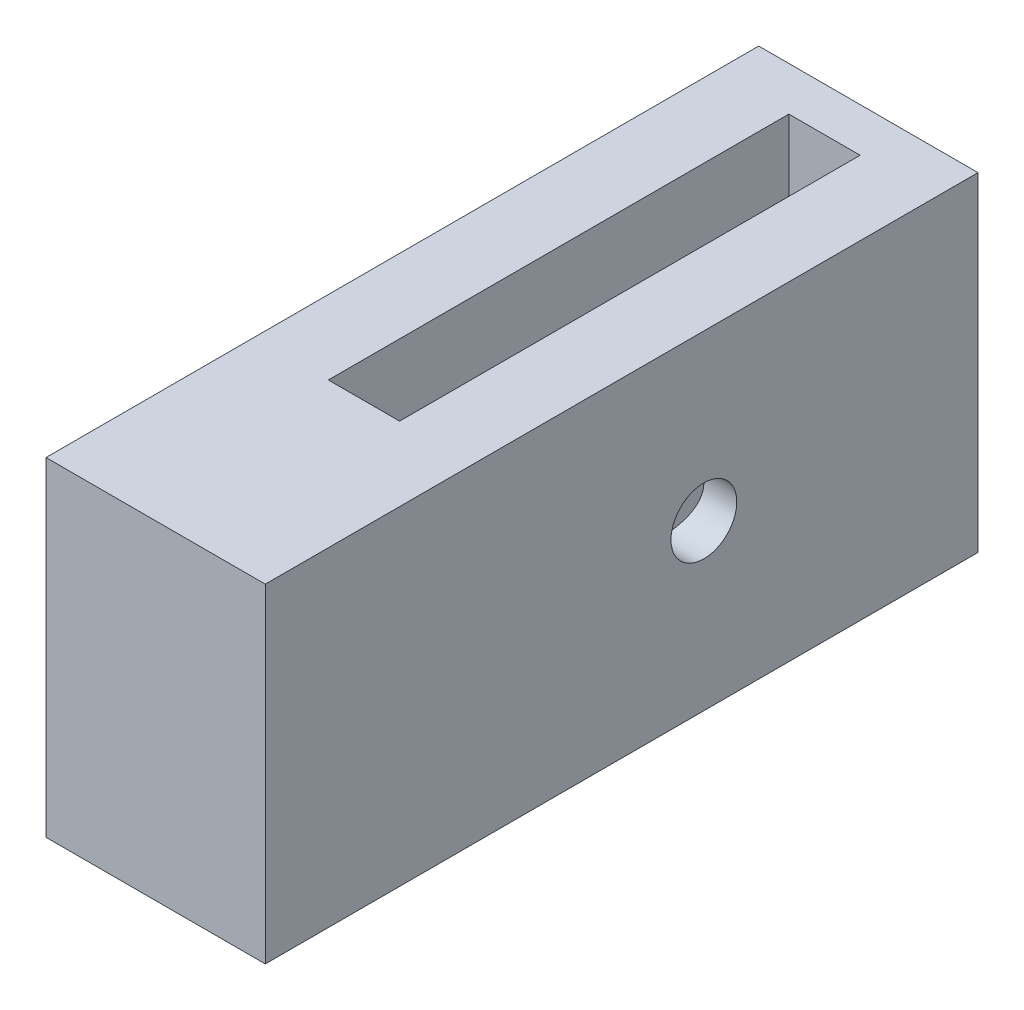
ISO-10303-21;
HEADER;
FILE_DESCRIPTION(('STEP AP214'),'2;1');
FILE_NAME('part.step','',(''),(''),'','','');
FILE_SCHEMA(('AUTOMOTIVE_DESIGN { 1 0 10303 214 1 1 1 1 }'));
ENDSEC;
DATA;
#1=APPLICATION_CONTEXT('core data for automotive mechanical design processes');
#2=APPLICATION_PROTOCOL_DEFINITION('international standard','automotive_design',2000,#1);
#3=PRODUCT_CONTEXT('',#1,'mechanical');
#4=PRODUCT('Part','Part','',(#3));
#5=PRODUCT_RELATED_PRODUCT_CATEGORY('part','',(#4));
#6=PRODUCT_DEFINITION_FORMATION('','',#4);
#7=PRODUCT_DEFINITION_CONTEXT('part definition',#1,'design');
#8=PRODUCT_DEFINITION('design','',#6,#7);
#9=PRODUCT_DEFINITION_SHAPE('','',#8);
#10=(LENGTH_UNIT() NAMED_UNIT(*) SI_UNIT(.MILLI.,.METRE.));
#11=(NAMED_UNIT(*) PLANE_ANGLE_UNIT() SI_UNIT($,.RADIAN.));
#12=(NAMED_UNIT(*) SI_UNIT($,.STERADIAN.) SOLID_ANGLE_UNIT());
#13=UNCERTAINTY_MEASURE_WITH_UNIT(LENGTH_MEASURE(1.E-05),#10,'distance_accuracy_value','');
#14=(GEOMETRIC_REPRESENTATION_CONTEXT(3) GLOBAL_UNCERTAINTY_ASSIGNED_CONTEXT((#13)) GLOBAL_UNIT_ASSIGNED_CONTEXT((#10,
#11,#12)) REPRESENTATION_CONTEXT('',''));
#15=CARTESIAN_POINT('',(0.,0.,0.));
#16=DIRECTION('',(0.,0.,1.));
#17=DIRECTION('',(1.,0.,0.));
#18=AXIS2_PLACEMENT_3D('',#15,#16,#17);
#19=CARTESIAN_POINT('',(10.,-15.,65.));
#20=DIRECTION('',(-1.,0.,0.));
#21=DIRECTION('',(0.,0.,1.));
#22=AXIS2_PLACEMENT_3D('',#19,#20,#21);
#23=PLANE('',#22);
#24=CARTESIAN_POINT('',(10.,0.,25.));
#25=DIRECTION('',(-1.,0.,0.));
#26=DIRECTION('',(0.,0.,1.));
#27=AXIS2_PLACEMENT_3D('',#24,#25,#26);
#28=CIRCLE('',#27,2.99999999999999);
#29=CARTESIAN_POINT('',(10.,0.,28.));
#30=VERTEX_POINT('',#29);
#31=EDGE_CURVE('E175',#30,#30,#28,.T.);
#32=ORIENTED_EDGE('',*,*,#31,.T.);
#33=EDGE_LOOP('',(#32));
#34=FACE_BOUND('',#33,.T.);
#35=DIRECTION('',(0.,1.,0.));
#36=VECTOR('',#35,1.);
#37=CARTESIAN_POINT('',(10.,-15.,0.));
#38=LINE('',#37,#36);
#39=CARTESIAN_POINT('',(10.,-15.,0.));
#40=VERTEX_POINT('',#39);
#41=CARTESIAN_POINT('',(10.,15.,0.));
#42=VERTEX_POINT('',#41);
#43=EDGE_CURVE('E184',#40,#42,#38,.T.);
#44=ORIENTED_EDGE('',*,*,#43,.T.);
#45=DIRECTION('',(0.,0.,-1.));
#46=VECTOR('',#45,1.);
#47=CARTESIAN_POINT('',(10.,15.,65.));
#48=LINE('',#47,#46);
#49=CARTESIAN_POINT('',(10.,15.,65.));
#50=VERTEX_POINT('',#49);
#51=EDGE_CURVE('E215',#50,#42,#48,.T.);
#52=ORIENTED_EDGE('',*,*,#51,.F.);
#53=DIRECTION('',(0.,1.,0.));
#54=VECTOR('',#53,1.);
#55=CARTESIAN_POINT('',(10.,-15.,65.));
#56=LINE('',#55,#54);
#57=CARTESIAN_POINT('',(10.,-15.,65.));
#58=VERTEX_POINT('',#57);
#59=EDGE_CURVE('E189',#58,#50,#56,.T.);
#60=ORIENTED_EDGE('',*,*,#59,.F.);
#61=DIRECTION('',(0.,0.,-1.));
#62=VECTOR('',#61,1.);
#63=CARTESIAN_POINT('',(10.,-15.,65.));
#64=LINE('',#63,#62);
#65=EDGE_CURVE('E199',#58,#40,#64,.T.);
#66=ORIENTED_EDGE('',*,*,#65,.T.);
#67=EDGE_LOOP('',(#44,#52,#60,#66));
#68=FACE_BOUND('',#67,.T.);
#69=ADVANCED_FACE('F39',(#34,#68),#23,.F.);
#70=CARTESIAN_POINT('',(-10.,15.,65.));
#71=DIRECTION('',(0.,-1.,0.));
#72=DIRECTION('',(0.,0.,-1.));
#73=AXIS2_PLACEMENT_3D('',#70,#71,#72);
#74=PLANE('',#73);
#75=DIRECTION('',(-1.,0.,0.));
#76=VECTOR('',#75,1.);
#77=CARTESIAN_POINT('',(-3.25,15.,4.));
#78=LINE('',#77,#76);
#79=CARTESIAN_POINT('',(3.25,15.,4.));
#80=VERTEX_POINT('',#79);
#81=CARTESIAN_POINT('',(-3.25,15.,4.));
#82=VERTEX_POINT('',#81);
#83=EDGE_CURVE('E161',#80,#82,#78,.T.);
#84=ORIENTED_EDGE('',*,*,#83,.F.);
#85=DIRECTION('',(0.,0.,-1.));
#86=VECTOR('',#85,1.);
#87=CARTESIAN_POINT('',(3.25,15.,46.));
#88=LINE('',#87,#86);
#89=CARTESIAN_POINT('',(3.25,15.,46.));
#90=VERTEX_POINT('',#89);
#91=EDGE_CURVE('E53',#90,#80,#88,.T.);
#92=ORIENTED_EDGE('',*,*,#91,.F.);
#93=DIRECTION('',(1.,0.,0.));
#94=VECTOR('',#93,1.);
#95=CARTESIAN_POINT('',(-3.25,15.,46.));
#96=LINE('',#95,#94);
#97=CARTESIAN_POINT('',(-3.25,15.,46.));
#98=VERTEX_POINT('',#97);
#99=EDGE_CURVE('E152',#98,#90,#96,.T.);
#100=ORIENTED_EDGE('',*,*,#99,.F.);
#101=DIRECTION('',(0.,0.,1.));
#102=VECTOR('',#101,1.);
#103=CARTESIAN_POINT('',(-3.25,15.,46.));
#104=LINE('',#103,#102);
#105=EDGE_CURVE('E155',#82,#98,#104,.T.);
#106=ORIENTED_EDGE('',*,*,#105,.F.);
#107=EDGE_LOOP('',(#84,#92,#100,#106));
#108=FACE_BOUND('',#107,.T.);
#109=DIRECTION('',(-1.,0.,0.));
#110=VECTOR('',#109,1.);
#111=CARTESIAN_POINT('',(-10.,15.,0.));
#112=LINE('',#111,#110);
#113=CARTESIAN_POINT('',(-10.,15.,0.));
#114=VERTEX_POINT('',#113);
#115=EDGE_CURVE('E202',#42,#114,#112,.T.);
#116=ORIENTED_EDGE('',*,*,#115,.T.);
#117=DIRECTION('',(0.,0.,-1.));
#118=VECTOR('',#117,1.);
#119=CARTESIAN_POINT('',(-10.,15.,65.));
#120=LINE('',#119,#118);
#121=CARTESIAN_POINT('',(-10.,15.,65.));
#122=VERTEX_POINT('',#121);
#123=EDGE_CURVE('E212',#122,#114,#120,.T.);
#124=ORIENTED_EDGE('',*,*,#123,.F.);
#125=DIRECTION('',(-1.,0.,0.));
#126=VECTOR('',#125,1.);
#127=CARTESIAN_POINT('',(-10.,15.,65.));
#128=LINE('',#127,#126);
#129=EDGE_CURVE('E192',#50,#122,#128,.T.);
#130=ORIENTED_EDGE('',*,*,#129,.F.);
#131=ORIENTED_EDGE('',*,*,#51,.T.);
#132=EDGE_LOOP('',(#116,#124,#130,#131));
#133=FACE_BOUND('',#132,.T.);
#134=ADVANCED_FACE('F254',(#108,#133),#74,.F.);
#135=CARTESIAN_POINT('',(-10.,-15.,65.));
#136=DIRECTION('',(1.,0.,0.));
#137=DIRECTION('',(0.,0.,-1.));
#138=AXIS2_PLACEMENT_3D('',#135,#136,#137);
#139=PLANE('',#138);
#140=CARTESIAN_POINT('',(-10.,0.,25.));
#141=DIRECTION('',(-1.,0.,0.));
#142=DIRECTION('',(0.,0.,1.));
#143=AXIS2_PLACEMENT_3D('',#140,#141,#142);
#144=CIRCLE('',#143,2.99999999999999);
#145=CARTESIAN_POINT('',(-10.,0.,28.));
#146=VERTEX_POINT('',#145);
#147=EDGE_CURVE('E168',#146,#146,#144,.T.);
#148=ORIENTED_EDGE('',*,*,#147,.F.);
#149=EDGE_LOOP('',(#148));
#150=FACE_BOUND('',#149,.T.);
#151=DIRECTION('',(0.,-1.,0.));
#152=VECTOR('',#151,1.);
#153=CARTESIAN_POINT('',(-10.,-15.,0.));
#154=LINE('',#153,#152);
#155=CARTESIAN_POINT('',(-10.,-15.,0.));
#156=VERTEX_POINT('',#155);
#157=EDGE_CURVE('E204',#114,#156,#154,.T.);
#158=ORIENTED_EDGE('',*,*,#157,.T.);
#159=DIRECTION('',(0.,0.,-1.));
#160=VECTOR('',#159,1.);
#161=CARTESIAN_POINT('',(-10.,-15.,65.));
#162=LINE('',#161,#160);
#163=CARTESIAN_POINT('',(-10.,-15.,65.));
#164=VERTEX_POINT('',#163);
#165=EDGE_CURVE('E209',#164,#156,#162,.T.);
#166=ORIENTED_EDGE('',*,*,#165,.F.);
#167=DIRECTION('',(0.,-1.,0.));
#168=VECTOR('',#167,1.);
#169=CARTESIAN_POINT('',(-10.,-15.,65.));
#170=LINE('',#169,#168);
#171=EDGE_CURVE('E195',#122,#164,#170,.T.);
#172=ORIENTED_EDGE('',*,*,#171,.F.);
#173=ORIENTED_EDGE('',*,*,#123,.T.);
#174=EDGE_LOOP('',(#158,#166,#172,#173));
#175=FACE_BOUND('',#174,.T.);
#176=ADVANCED_FACE('F260',(#150,#175),#139,.F.);
#177=CARTESIAN_POINT('',(-10.,-15.,65.));
#178=DIRECTION('',(0.,1.,0.));
#179=DIRECTION('',(0.,0.,1.));
#180=AXIS2_PLACEMENT_3D('',#177,#178,#179);
#181=PLANE('',#180);
#182=DIRECTION('',(1.,0.,0.));
#183=VECTOR('',#182,1.);
#184=CARTESIAN_POINT('',(-3.25,-15.,46.));
#185=LINE('',#184,#183);
#186=CARTESIAN_POINT('',(-3.25,-15.,46.));
#187=VERTEX_POINT('',#186);
#188=CARTESIAN_POINT('',(3.25,-15.,46.));
#189=VERTEX_POINT('',#188);
#190=EDGE_CURVE('E151',#187,#189,#185,.T.);
#191=ORIENTED_EDGE('',*,*,#190,.T.);
#192=DIRECTION('',(0.,0.,-1.));
#193=VECTOR('',#192,1.);
#194=CARTESIAN_POINT('',(3.25,-15.,46.));
#195=LINE('',#194,#193);
#196=CARTESIAN_POINT('',(3.25,-15.,4.));
#197=VERTEX_POINT('',#196);
#198=EDGE_CURVE('E133',#189,#197,#195,.T.);
#199=ORIENTED_EDGE('',*,*,#198,.T.);
#200=DIRECTION('',(-1.,0.,0.));
#201=VECTOR('',#200,1.);
#202=CARTESIAN_POINT('',(-3.25,-15.,4.));
#203=LINE('',#202,#201);
#204=CARTESIAN_POINT('',(-3.25,-15.,4.));
#205=VERTEX_POINT('',#204);
#206=EDGE_CURVE('E143',#197,#205,#203,.T.);
#207=ORIENTED_EDGE('',*,*,#206,.T.);
#208=DIRECTION('',(0.,0.,1.));
#209=VECTOR('',#208,1.);
#210=CARTESIAN_POINT('',(-3.25,-15.,46.));
#211=LINE('',#210,#209);
#212=EDGE_CURVE('E61',#205,#187,#211,.T.);
#213=ORIENTED_EDGE('',*,*,#212,.T.);
#214=EDGE_LOOP('',(#191,#199,#207,#213));
#215=FACE_BOUND('',#214,.T.);
#216=DIRECTION('',(1.,0.,0.));
#217=VECTOR('',#216,1.);
#218=CARTESIAN_POINT('',(-10.,-15.,0.));
#219=LINE('',#218,#217);
#220=EDGE_CURVE('E193',#156,#40,#219,.T.);
#221=ORIENTED_EDGE('',*,*,#220,.T.);
#222=ORIENTED_EDGE('',*,*,#65,.F.);
#223=DIRECTION('',(1.,0.,0.));
#224=VECTOR('',#223,1.);
#225=CARTESIAN_POINT('',(-10.,-15.,65.));
#226=LINE('',#225,#224);
#227=EDGE_CURVE('E197',#164,#58,#226,.T.);
#228=ORIENTED_EDGE('',*,*,#227,.F.);
#229=ORIENTED_EDGE('',*,*,#165,.T.);
#230=EDGE_LOOP('',(#221,#222,#228,#229));
#231=FACE_BOUND('',#230,.T.);
#232=ADVANCED_FACE('F148',(#215,#231),#181,.F.);
#233=CARTESIAN_POINT('',(0.,0.,65.));
#234=DIRECTION('',(0.,0.,-1.));
#235=DIRECTION('',(-1.,0.,0.));
#236=AXIS2_PLACEMENT_3D('',#233,#234,#235);
#237=PLANE('',#236);
#238=ORIENTED_EDGE('',*,*,#59,.T.);
#239=ORIENTED_EDGE('',*,*,#129,.T.);
#240=ORIENTED_EDGE('',*,*,#171,.T.);
#241=ORIENTED_EDGE('',*,*,#227,.T.);
#242=EDGE_LOOP('',(#238,#239,#240,#241));
#243=FACE_BOUND('',#242,.T.);
#244=ADVANCED_FACE('F275',(#243),#237,.F.);
#245=CARTESIAN_POINT('',(0.,0.,0.));
#246=DIRECTION('',(0.,0.,-1.));
#247=DIRECTION('',(-1.,0.,0.));
#248=AXIS2_PLACEMENT_3D('',#245,#246,#247);
#249=PLANE('',#248);
#250=CARTESIAN_POINT('',(0.,0.,0.));
#251=DIRECTION('',(0.,0.,1.));
#252=DIRECTION('',(1.,0.,0.));
#253=AXIS2_PLACEMENT_3D('',#250,#251,#252);
#254=CIRCLE('',#253,7.);
#255=CARTESIAN_POINT('',(7.,0.,0.));
#256=VERTEX_POINT('',#255);
#257=EDGE_CURVE('E185',#256,#256,#254,.T.);
#258=ORIENTED_EDGE('',*,*,#257,.T.);
#259=EDGE_LOOP('',(#258));
#260=FACE_BOUND('',#259,.T.);
#261=ORIENTED_EDGE('',*,*,#43,.F.);
#262=ORIENTED_EDGE('',*,*,#220,.F.);
#263=ORIENTED_EDGE('',*,*,#157,.F.);
#264=ORIENTED_EDGE('',*,*,#115,.F.);
#265=EDGE_LOOP('',(#261,#262,#263,#264));
#266=FACE_BOUND('',#265,.T.);
#267=ADVANCED_FACE('F251',(#260,#266),#249,.T.);
#268=CARTESIAN_POINT('',(0.,0.,60.));
#269=DIRECTION('',(0.,0.,-1.));
#270=DIRECTION('',(-1.,0.,0.));
#271=AXIS2_PLACEMENT_3D('',#268,#269,#270);
#272=CYLINDRICAL_SURFACE('',#271,7.);
#273=DIRECTION('',(0.,0.,-1.));
#274=VECTOR('',#273,1.);
#275=CARTESIAN_POINT('',(3.25,6.19979838381862,60.));
#276=LINE('',#275,#274);
#277=CARTESIAN_POINT('',(3.25,6.19979838381862,4.));
#278=VERTEX_POINT('',#277);
#279=CARTESIAN_POINT('',(3.25,6.19979838381862,46.));
#280=VERTEX_POINT('',#279);
#281=EDGE_CURVE('E11',#278,#280,#276,.F.);
#282=ORIENTED_EDGE('',*,*,#281,.F.);
#283=CARTESIAN_POINT('',(0.,0.,4.));
#284=DIRECTION('',(0.,0.,-1.));
#285=DIRECTION('',(-1.,0.,0.));
#286=AXIS2_PLACEMENT_3D('',#283,#284,#285);
#287=CIRCLE('',#286,7.);
#288=CARTESIAN_POINT('',(-3.25,6.19979838381862,4.));
#289=VERTEX_POINT('',#288);
#290=EDGE_CURVE('E404',#289,#278,#287,.T.);
#291=ORIENTED_EDGE('',*,*,#290,.F.);
#292=DIRECTION('',(0.,0.,-1.));
#293=VECTOR('',#292,1.);
#294=CARTESIAN_POINT('',(-3.25,6.19979838381862,60.));
#295=LINE('',#294,#293);
#296=CARTESIAN_POINT('',(-3.25,6.19979838381862,46.));
#297=VERTEX_POINT('',#296);
#298=EDGE_CURVE('E401',#297,#289,#295,.T.);
#299=ORIENTED_EDGE('',*,*,#298,.F.);
#300=CARTESIAN_POINT('',(0.,0.,46.));
#301=DIRECTION('',(0.,0.,1.));
#302=DIRECTION('',(1.,0.,0.));
#303=AXIS2_PLACEMENT_3D('',#300,#301,#302);
#304=CIRCLE('',#303,7.);
#305=EDGE_CURVE('E46',#280,#297,#304,.T.);
#306=ORIENTED_EDGE('',*,*,#305,.F.);
#307=EDGE_LOOP('',(#282,#291,#299,#306));
#308=FACE_BOUND('',#307,.T.);
#309=DIRECTION('',(0.,0.,-1.));
#310=VECTOR('',#309,1.);
#311=CARTESIAN_POINT('',(3.25,-6.19979838381862,60.));
#312=LINE('',#311,#310);
#313=CARTESIAN_POINT('',(3.25,-6.19979838381862,46.));
#314=VERTEX_POINT('',#313);
#315=CARTESIAN_POINT('',(3.25,-6.19979838381862,4.));
#316=VERTEX_POINT('',#315);
#317=EDGE_CURVE('E136',#314,#316,#312,.T.);
#318=ORIENTED_EDGE('',*,*,#317,.F.);
#319=CARTESIAN_POINT('',(-3.25,-6.19979838381862,46.));
#320=VERTEX_POINT('',#319);
#321=EDGE_CURVE('E403',#320,#314,#304,.T.);
#322=ORIENTED_EDGE('',*,*,#321,.F.);
#323=DIRECTION('',(0.,0.,-1.));
#324=VECTOR('',#323,1.);
#325=CARTESIAN_POINT('',(-3.25,-6.19979838381862,60.));
#326=LINE('',#325,#324);
#327=CARTESIAN_POINT('',(-3.25,-6.19979838381862,4.));
#328=VERTEX_POINT('',#327);
#329=EDGE_CURVE('E407',#328,#320,#326,.F.);
#330=ORIENTED_EDGE('',*,*,#329,.F.);
#331=EDGE_CURVE('E218',#316,#328,#287,.T.);
#332=ORIENTED_EDGE('',*,*,#331,.F.);
#333=EDGE_LOOP('',(#318,#322,#330,#332));
#334=FACE_BOUND('',#333,.T.);
#335=CARTESIAN_POINT('',(-7.,0.,28.));
#336=CARTESIAN_POINT('',(-6.9999940839629,-0.160281740269091,27.9999925304185));
#337=CARTESIAN_POINT('',(-6.99443250051265,-0.320833907522429,27.9870786839035));
#338=CARTESIAN_POINT('',(-6.97273920628719,-0.637349314958983,27.9359176345735));
#339=CARTESIAN_POINT('',(-6.95658080950724,-0.793299928144205,27.8976064709266));
#340=CARTESIAN_POINT('',(-6.91541630739346,-1.09553470514829,27.7973302363749));
#341=CARTESIAN_POINT('',(-6.89044089228941,-1.24185033642246,27.7354471561946));
#342=CARTESIAN_POINT('',(-6.83405660276648,-1.5218733278968,27.5901355814363));
#343=CARTESIAN_POINT('',(-6.80264947176647,-1.6555840905338,27.5067129239082));
#344=CARTESIAN_POINT('',(-6.7346782187555,-1.91384144205638,27.3160723523121));
#345=CARTESIAN_POINT('',(-6.69793895962371,-2.03764045493602,27.2079047401042));
#346=CARTESIAN_POINT('',(-6.62417654338771,-2.26599040232608,26.9728561314992));
#347=CARTESIAN_POINT('',(-6.5871532404671,-2.3705306503261,26.8459648153973));
#348=CARTESIAN_POINT('',(-6.51482055271223,-2.56285686126492,26.5689672772845));
#349=CARTESIAN_POINT('',(-6.47970460244925,-2.64946811752635,26.4179895419707));
#350=CARTESIAN_POINT('',(-6.41796168635027,-2.795731994081,26.101890571811));
#351=CARTESIAN_POINT('',(-6.39133010120134,-2.85539929142629,25.9367770955138));
#352=CARTESIAN_POINT('',(-6.35147799087276,-2.94294919918374,25.6056992616908));
#353=CARTESIAN_POINT('',(-6.3376522143554,-2.97227494401776,25.4401922982205));
#354=CARTESIAN_POINT('',(-6.32324849688131,-3.00280607158394,25.1060740303897));
#355=CARTESIAN_POINT('',(-6.3226626262515,-3.00402828615095,24.9374646447086));
#356=CARTESIAN_POINT('',(-6.3342957390254,-2.97939999510612,24.6167000962814));
#357=CARTESIAN_POINT('',(-6.34546870930158,-2.95576113815071,24.464329376668));
#358=CARTESIAN_POINT('',(-6.37758411517576,-2.88580772808798,24.1659724140987));
#359=CARTESIAN_POINT('',(-6.39852855266592,-2.83948852833538,24.0199874861139));
#360=CARTESIAN_POINT('',(-6.44830685655466,-2.7245765907069,23.7347528485648));
#361=CARTESIAN_POINT('',(-6.47730295111392,-2.65551974428425,23.5957197057819));
#362=CARTESIAN_POINT('',(-6.53988493882129,-2.49742304873012,23.3306536759306));
#363=CARTESIAN_POINT('',(-6.57347269593628,-2.40837507480489,23.2046261050705));
#364=CARTESIAN_POINT('',(-6.64512404535213,-2.20343405392229,22.9572224963786));
#365=CARTESIAN_POINT('',(-6.68331855389209,-2.08584728856133,22.837283270528));
#366=CARTESIAN_POINT('',(-6.75734605758523,-1.83187332405076,22.6183284093441));
#367=CARTESIAN_POINT('',(-6.79317843254652,-1.69548121627989,22.5193182541218));
#368=CARTESIAN_POINT('',(-6.8595969368957,-1.40318582301271,22.342756067193));
#369=CARTESIAN_POINT('',(-6.89002455033727,-1.24687114970231,22.2658209812944));
#370=CARTESIAN_POINT('',(-6.94097396260558,-0.92187969415893,22.1398497623853));
#371=CARTESIAN_POINT('',(-6.96150156039981,-0.753210215657661,22.0907972940223));
#372=CARTESIAN_POINT('',(-6.98923526893385,-0.420276238941368,22.025066139541));
#373=CARTESIAN_POINT('',(-6.99723249964589,-0.256457961010922,22.0064612346856));
#374=CARTESIAN_POINT('',(-7.00155416651738,0.0721433011185083,21.9963704235918));
#375=CARTESIAN_POINT('',(-6.99788220531666,0.236925971900557,22.0048761474676));
#376=CARTESIAN_POINT('',(-6.9797867632015,0.553542439626672,22.0474156320548));
#377=CARTESIAN_POINT('',(-6.96594519473644,0.705598931504218,22.0800683214483));
#378=CARTESIAN_POINT('',(-6.92953888009974,1.00189113639242,22.1680208942382));
#379=CARTESIAN_POINT('',(-6.90697304848521,1.14612587370002,22.2233235957222));
#380=CARTESIAN_POINT('',(-6.8543875151372,1.42777696523888,22.3568011595021));
#381=CARTESIAN_POINT('',(-6.82415705388474,1.56483974951836,22.4356363302261));
#382=CARTESIAN_POINT('',(-6.75942988391438,1.82428490564705,22.6132189444759));
#383=CARTESIAN_POINT('',(-6.72493135648758,1.94666097512992,22.7119748880233));
#384=CARTESIAN_POINT('',(-6.65214788697903,2.18296759532595,22.9352895878429));
#385=CARTESIAN_POINT('',(-6.61377354998591,2.29556617553685,23.0612322100614));
#386=CARTESIAN_POINT('',(-6.53984037690253,2.49843431443676,23.3307822986316));
#387=CARTESIAN_POINT('',(-6.50428232556792,2.58869766421195,23.4743946603748));
#388=CARTESIAN_POINT('',(-6.4396296928532,2.74563875632303,23.7788138529586));
#389=CARTESIAN_POINT('',(-6.41066255987443,2.81186415020233,23.93988300905));
#390=CARTESIAN_POINT('',(-6.36413607530145,2.91565885028324,24.2725263267395));
#391=CARTESIAN_POINT('',(-6.346566580073,2.95325364225747,24.4440909983246));
#392=CARTESIAN_POINT('',(-6.32643481136621,2.99611948419969,24.777991172333));
#393=CARTESIAN_POINT('',(-6.32277925665461,3.0037469323845,24.9399592675106));
#394=CARTESIAN_POINT('',(-6.32795618271386,2.99282649265777,25.2627897469115));
#395=CARTESIAN_POINT('',(-6.33678646098226,2.97428322126542,25.4236523211193));
#396=CARTESIAN_POINT('',(-6.36491653890771,2.91356431394149,25.7310416962734));
#397=CARTESIAN_POINT('',(-6.38364713099397,2.87266975661121,25.8778787915708));
#398=CARTESIAN_POINT('',(-6.42898875831973,2.76970222363199,26.1626207660839));
#399=CARTESIAN_POINT('',(-6.45560203384716,2.70762322652258,26.3005230924077));
#400=CARTESIAN_POINT('',(-6.5157524732596,2.55963250501148,26.5728207086796));
#401=CARTESIAN_POINT('',(-6.5496164957701,2.47248232196068,26.7064691536948));
#402=CARTESIAN_POINT('',(-6.61959778926567,2.27849600925129,26.9579823612475));
#403=CARTESIAN_POINT('',(-6.6557159087398,2.17165243666714,27.0758411270492));
#404=CARTESIAN_POINT('',(-6.72955424641834,1.93135048700132,27.3020036355007));
#405=CARTESIAN_POINT('',(-6.76717599448736,1.79645724733278,27.4088195655728));
#406=CARTESIAN_POINT('',(-6.83696477009089,1.50919760355,27.5984397600312));
#407=CARTESIAN_POINT('',(-6.86912932173673,1.35682332068822,27.6812331375999));
#408=CARTESIAN_POINT('',(-6.91035442086788,1.11954532843041,27.7845926909895));
#409=CARTESIAN_POINT('',(-6.92286397965452,1.0395728802483,27.8154332908018));
#410=CARTESIAN_POINT('',(-6.94533202163241,0.87697080278269,27.8702382020223));
#411=CARTESIAN_POINT('',(-6.95529172101822,0.794342461515161,27.8942057922754));
#412=CARTESIAN_POINT('',(-6.97234378079151,0.627265567421392,27.9349477172834));
#413=CARTESIAN_POINT('',(-6.97944312738119,0.542821986677281,27.9517395843805));
#414=CARTESIAN_POINT('',(-6.99059319635283,0.37264790683931,27.9780087142034));
#415=CARTESIAN_POINT('',(-6.99464610559385,0.286918376030201,27.9874912240139));
#416=CARTESIAN_POINT('',(-6.99807592564235,0.167492669563773,27.9955082749436));
#417=CARTESIAN_POINT('',(-6.99879677015532,0.134021137958665,27.9971918541176));
#418=CARTESIAN_POINT('',(-6.99975942751561,0.0670370145842112,27.9994385012841));
#419=CARTESIAN_POINT('',(-7.0000012373944,0.0335244225617059,28.0000015623327));
#420=CARTESIAN_POINT('',(-7.,0.,28.));
#421=B_SPLINE_CURVE_WITH_KNOTS('',3,(#335,#336,#337,#338,#339,#340,#341,#342,#343,#344,#345,
#346,#347,#348,#349,#350,#351,#352,#353,#354,#355,#356,#357,#358,#359,#360,#361,#362,#363,#364,
#365,#366,#367,#368,#369,#370,#371,#372,#373,#374,#375,#376,#377,#378,#379,#380,#381,#382,#383,
#384,#385,#386,#387,#388,#389,#390,#391,#392,#393,#394,#395,#396,#397,#398,#399,#400,#401,#402,
#403,#404,#405,#406,#407,#408,#409,#410,#411,#412,#413,#414,#415,#416,#417,#418,#419,#420),
.UNSPECIFIED.,.T.,.F.,(4,2,2,2,2,2,2,2,2,2,2,2,2,2,2,2,2,2,2,2,2,2,2,2,2,2,2,2,2,2,2,2,2,2,2,2,
2,2,2,2,2,2,4),(0.,0.480714322748848,0.962643903423345,1.44291226275142,1.92305060961531,
2.42622743558506,2.92968263421743,3.45969560860061,3.98941952228262,4.49259426828099,
4.99546764377914,5.45710720323576,5.91884138089947,6.39065408872319,6.86265889892284,
7.37709837725839,7.89167239108962,8.41947244601233,8.94696296364741,9.43957347502026,
9.93203191709567,10.3983119423363,10.8646499992176,11.345550551622,11.8266567358409,
12.3440285038672,12.8615439335848,13.3883469079738,13.9146803943341,14.3986848887267,
14.882604015318,15.341320451094,15.8001673810816,16.2874475008663,16.7749121624767,
17.3008416934143,17.8270092002162,18.0865840789243,18.34603491778,18.6048481685098,
18.8634754544624,18.9640207205289,19.0645666096629),.UNSPECIFIED.);
#422=CARTESIAN_POINT('',(-7.,0.,28.));
#423=VERTEX_POINT('',#422);
#424=EDGE_CURVE('E188',#423,#423,#421,.T.);
#425=ORIENTED_EDGE('',*,*,#424,.F.);
#426=EDGE_LOOP('',(#425));
#427=FACE_BOUND('',#426,.T.);
#428=CARTESIAN_POINT('',(7.,0.,28.));
#429=CARTESIAN_POINT('',(6.9999940839629,0.160281740269091,27.9999925304185));
#430=CARTESIAN_POINT('',(6.99443250051265,0.320833907522429,27.9870786839035));
#431=CARTESIAN_POINT('',(6.97273920628719,0.637349314958983,27.9359176345735));
#432=CARTESIAN_POINT('',(6.95658080950724,0.793299928144205,27.8976064709266));
#433=CARTESIAN_POINT('',(6.91541630739346,1.09553470514829,27.7973302363749));
#434=CARTESIAN_POINT('',(6.89044089228941,1.24185033642246,27.7354471561946));
#435=CARTESIAN_POINT('',(6.83405660276648,1.5218733278968,27.5901355814363));
#436=CARTESIAN_POINT('',(6.80264947176647,1.6555840905338,27.5067129239082));
#437=CARTESIAN_POINT('',(6.7346782187555,1.91384144205638,27.3160723523121));
#438=CARTESIAN_POINT('',(6.69793895962371,2.03764045493602,27.2079047401042));
#439=CARTESIAN_POINT('',(6.62417654338771,2.26599040232608,26.9728561314992));
#440=CARTESIAN_POINT('',(6.5871532404671,2.3705306503261,26.8459648153973));
#441=CARTESIAN_POINT('',(6.51482055271223,2.56285686126492,26.5689672772845));
#442=CARTESIAN_POINT('',(6.47970460244925,2.64946811752635,26.4179895419707));
#443=CARTESIAN_POINT('',(6.41796168635027,2.795731994081,26.101890571811));
#444=CARTESIAN_POINT('',(6.39133010120134,2.85539929142629,25.9367770955138));
#445=CARTESIAN_POINT('',(6.35147799087276,2.94294919918374,25.6056992616908));
#446=CARTESIAN_POINT('',(6.3376522143554,2.97227494401776,25.4401922982205));
#447=CARTESIAN_POINT('',(6.32324849688131,3.00280607158394,25.1060740303897));
#448=CARTESIAN_POINT('',(6.3226626262515,3.00402828615095,24.9374646447086));
#449=CARTESIAN_POINT('',(6.3342957390254,2.97939999510612,24.6167000962814));
#450=CARTESIAN_POINT('',(6.34546870930158,2.95576113815071,24.464329376668));
#451=CARTESIAN_POINT('',(6.37758411517576,2.88580772808798,24.1659724140987));
#452=CARTESIAN_POINT('',(6.39852855266592,2.83948852833538,24.0199874861139));
#453=CARTESIAN_POINT('',(6.44830685655466,2.7245765907069,23.7347528485648));
#454=CARTESIAN_POINT('',(6.47730295111392,2.65551974428425,23.5957197057819));
#455=CARTESIAN_POINT('',(6.53988493882129,2.49742304873012,23.3306536759306));
#456=CARTESIAN_POINT('',(6.57347269593628,2.40837507480489,23.2046261050705));
#457=CARTESIAN_POINT('',(6.64512404535213,2.20343405392229,22.9572224963786));
#458=CARTESIAN_POINT('',(6.68331855389209,2.08584728856133,22.837283270528));
#459=CARTESIAN_POINT('',(6.75734605758523,1.83187332405076,22.6183284093441));
#460=CARTESIAN_POINT('',(6.79317843254652,1.69548121627989,22.5193182541218));
#461=CARTESIAN_POINT('',(6.8595969368957,1.40318582301271,22.342756067193));
#462=CARTESIAN_POINT('',(6.89002455033727,1.24687114970231,22.2658209812944));
#463=CARTESIAN_POINT('',(6.94097396260558,0.92187969415893,22.1398497623853));
#464=CARTESIAN_POINT('',(6.96150156039981,0.753210215657661,22.0907972940223));
#465=CARTESIAN_POINT('',(6.98923526893385,0.420276238941368,22.025066139541));
#466=CARTESIAN_POINT('',(6.99723249964589,0.256457961010922,22.0064612346856));
#467=CARTESIAN_POINT('',(7.00155416651738,-0.0721433011185083,21.9963704235918));
#468=CARTESIAN_POINT('',(6.99788220531666,-0.236925971900557,22.0048761474676));
#469=CARTESIAN_POINT('',(6.9797867632015,-0.553542439626672,22.0474156320548));
#470=CARTESIAN_POINT('',(6.96594519473644,-0.705598931504218,22.0800683214483));
#471=CARTESIAN_POINT('',(6.92953888009974,-1.00189113639242,22.1680208942382));
#472=CARTESIAN_POINT('',(6.90697304848521,-1.14612587370002,22.2233235957222));
#473=CARTESIAN_POINT('',(6.8543875151372,-1.42777696523888,22.3568011595021));
#474=CARTESIAN_POINT('',(6.82415705388474,-1.56483974951836,22.4356363302261));
#475=CARTESIAN_POINT('',(6.75942988391438,-1.82428490564705,22.6132189444759));
#476=CARTESIAN_POINT('',(6.72493135648758,-1.94666097512992,22.7119748880233));
#477=CARTESIAN_POINT('',(6.65214788697903,-2.18296759532595,22.9352895878429));
#478=CARTESIAN_POINT('',(6.61377354998591,-2.29556617553685,23.0612322100614));
#479=CARTESIAN_POINT('',(6.53984037690253,-2.49843431443676,23.3307822986316));
#480=CARTESIAN_POINT('',(6.50428232556792,-2.58869766421195,23.4743946603748));
#481=CARTESIAN_POINT('',(6.4396296928532,-2.74563875632303,23.7788138529586));
#482=CARTESIAN_POINT('',(6.41066255987443,-2.81186415020233,23.93988300905));
#483=CARTESIAN_POINT('',(6.36413607530145,-2.91565885028324,24.2725263267395));
#484=CARTESIAN_POINT('',(6.346566580073,-2.95325364225747,24.4440909983246));
#485=CARTESIAN_POINT('',(6.32643481136621,-2.99611948419969,24.777991172333));
#486=CARTESIAN_POINT('',(6.32277925665461,-3.0037469323845,24.9399592675106));
#487=CARTESIAN_POINT('',(6.32795618271386,-2.99282649265777,25.2627897469115));
#488=CARTESIAN_POINT('',(6.33678646098226,-2.97428322126542,25.4236523211193));
#489=CARTESIAN_POINT('',(6.36491653890771,-2.91356431394149,25.7310416962734));
#490=CARTESIAN_POINT('',(6.38364713099397,-2.87266975661121,25.8778787915708));
#491=CARTESIAN_POINT('',(6.42898875831973,-2.76970222363199,26.1626207660839));
#492=CARTESIAN_POINT('',(6.45560203384716,-2.70762322652258,26.3005230924077));
#493=CARTESIAN_POINT('',(6.5157524732596,-2.55963250501148,26.5728207086796));
#494=CARTESIAN_POINT('',(6.5496164957701,-2.47248232196068,26.7064691536948));
#495=CARTESIAN_POINT('',(6.61959778926567,-2.27849600925129,26.9579823612475));
#496=CARTESIAN_POINT('',(6.6557159087398,-2.17165243666714,27.0758411270492));
#497=CARTESIAN_POINT('',(6.72955424641834,-1.93135048700132,27.3020036355007));
#498=CARTESIAN_POINT('',(6.76717599448736,-1.79645724733278,27.4088195655728));
#499=CARTESIAN_POINT('',(6.83696477009089,-1.50919760355,27.5984397600312));
#500=CARTESIAN_POINT('',(6.86912932173673,-1.35682332068822,27.6812331375999));
#501=CARTESIAN_POINT('',(6.91035442086788,-1.11954532843041,27.7845926909895));
#502=CARTESIAN_POINT('',(6.92286397965452,-1.0395728802483,27.8154332908018));
#503=CARTESIAN_POINT('',(6.94533202163241,-0.87697080278269,27.8702382020223));
#504=CARTESIAN_POINT('',(6.95529172101822,-0.794342461515161,27.8942057922754));
#505=CARTESIAN_POINT('',(6.97234378079151,-0.627265567421392,27.9349477172834));
#506=CARTESIAN_POINT('',(6.97944312738119,-0.542821986677281,27.9517395843805));
#507=CARTESIAN_POINT('',(6.99059319635283,-0.37264790683931,27.9780087142034));
#508=CARTESIAN_POINT('',(6.99464610559385,-0.286918376030201,27.9874912240139));
#509=CARTESIAN_POINT('',(6.99807592564235,-0.167492669563773,27.9955082749436));
#510=CARTESIAN_POINT('',(6.99879677015532,-0.134021137958665,27.9971918541176));
#511=CARTESIAN_POINT('',(6.99975942751561,-0.0670370145842112,27.9994385012841));
#512=CARTESIAN_POINT('',(7.0000012373944,-0.0335244225617059,28.0000015623327));
#513=CARTESIAN_POINT('',(7.,0.,28.));
#514=B_SPLINE_CURVE_WITH_KNOTS('',3,(#428,#429,#430,#431,#432,#433,#434,#435,#436,#437,#438,
#439,#440,#441,#442,#443,#444,#445,#446,#447,#448,#449,#450,#451,#452,#453,#454,#455,#456,#457,
#458,#459,#460,#461,#462,#463,#464,#465,#466,#467,#468,#469,#470,#471,#472,#473,#474,#475,#476,
#477,#478,#479,#480,#481,#482,#483,#484,#485,#486,#487,#488,#489,#490,#491,#492,#493,#494,#495,
#496,#497,#498,#499,#500,#501,#502,#503,#504,#505,#506,#507,#508,#509,#510,#511,#512,#513),
.UNSPECIFIED.,.T.,.F.,(4,2,2,2,2,2,2,2,2,2,2,2,2,2,2,2,2,2,2,2,2,2,2,2,2,2,2,2,2,2,2,2,2,2,2,2,
2,2,2,2,2,2,4),(0.,0.480714322748848,0.962643903423345,1.44291226275142,1.92305060961531,
2.42622743558506,2.92968263421743,3.45969560860061,3.98941952228262,4.49259426828099,
4.99546764377914,5.45710720323576,5.91884138089947,6.39065408872319,6.86265889892284,
7.37709837725839,7.89167239108962,8.41947244601233,8.94696296364741,9.43957347502026,
9.93203191709567,10.3983119423363,10.8646499992176,11.345550551622,11.8266567358409,
12.3440285038672,12.8615439335848,13.3883469079738,13.9146803943341,14.3986848887267,
14.882604015318,15.341320451094,15.8001673810816,16.2874475008663,16.7749121624767,
17.3008416934143,17.8270092002162,18.0865840789243,18.34603491778,18.6048481685098,
18.8634754544624,18.9640207205289,19.0645666096629),.UNSPECIFIED.);
#515=CARTESIAN_POINT('',(7.,0.,28.));
#516=VERTEX_POINT('',#515);
#517=EDGE_CURVE('E178',#516,#516,#514,.T.);
#518=ORIENTED_EDGE('',*,*,#517,.F.);
#519=EDGE_LOOP('',(#518));
#520=FACE_BOUND('',#519,.T.);
#521=CARTESIAN_POINT('',(0.,0.,60.));
#522=DIRECTION('',(0.,0.,1.));
#523=DIRECTION('',(1.,0.,0.));
#524=AXIS2_PLACEMENT_3D('',#521,#522,#523);
#525=CIRCLE('',#524,7.);
#526=CARTESIAN_POINT('',(7.,0.,60.));
#527=VERTEX_POINT('',#526);
#528=EDGE_CURVE('E181',#527,#527,#525,.T.);
#529=ORIENTED_EDGE('',*,*,#528,.T.);
#530=EDGE_LOOP('',(#529));
#531=FACE_BOUND('',#530,.T.);
#532=ORIENTED_EDGE('',*,*,#257,.F.);
#533=EDGE_LOOP('',(#532));
#534=FACE_BOUND('',#533,.T.);
#535=ADVANCED_FACE('F230',(#308,#334,#427,#520,#531,#534),#272,.F.);
#536=CARTESIAN_POINT('',(0.,0.,60.));
#537=DIRECTION('',(0.,0.,1.));
#538=DIRECTION('',(1.,0.,0.));
#539=AXIS2_PLACEMENT_3D('',#536,#537,#538);
#540=PLANE('',#539);
#541=ORIENTED_EDGE('',*,*,#528,.F.);
#542=EDGE_LOOP('',(#541));
#543=FACE_BOUND('',#542,.T.);
#544=ADVANCED_FACE('F239',(#543),#540,.F.);
#545=CARTESIAN_POINT('',(10.,0.,25.));
#546=DIRECTION('',(-1.,0.,0.));
#547=DIRECTION('',(0.,0.,1.));
#548=AXIS2_PLACEMENT_3D('',#545,#546,#547);
#549=CYLINDRICAL_SURFACE('',#548,2.99999999999999);
#550=ORIENTED_EDGE('',*,*,#517,.T.);
#551=EDGE_LOOP('',(#550));
#552=FACE_BOUND('',#551,.T.);
#553=ORIENTED_EDGE('',*,*,#31,.F.);
#554=EDGE_LOOP('',(#553));
#555=FACE_BOUND('',#554,.T.);
#556=ADVANCED_FACE('F234',(#552,#555),#549,.F.);
#557=ORIENTED_EDGE('',*,*,#424,.T.);
#558=EDGE_LOOP('',(#557));
#559=FACE_BOUND('',#558,.T.);
#560=ORIENTED_EDGE('',*,*,#147,.T.);
#561=EDGE_LOOP('',(#560));
#562=FACE_BOUND('',#561,.T.);
#563=ADVANCED_FACE('F238',(#559,#562),#549,.F.);
#564=CARTESIAN_POINT('',(-3.25,-15.,4.));
#565=DIRECTION('',(0.,0.,-1.));
#566=DIRECTION('',(-1.,0.,0.));
#567=AXIS2_PLACEMENT_3D('',#564,#565,#566);
#568=PLANE('',#567);
#569=ORIENTED_EDGE('',*,*,#331,.T.);
#570=DIRECTION('',(0.,1.,0.));
#571=VECTOR('',#570,1.);
#572=CARTESIAN_POINT('',(-3.25,-15.,4.));
#573=LINE('',#572,#571);
#574=EDGE_CURVE('E145',#205,#328,#573,.T.);
#575=ORIENTED_EDGE('',*,*,#574,.F.);
#576=ORIENTED_EDGE('',*,*,#206,.F.);
#577=DIRECTION('',(0.,1.,0.));
#578=VECTOR('',#577,1.);
#579=CARTESIAN_POINT('',(3.25,-15.,4.));
#580=LINE('',#579,#578);
#581=EDGE_CURVE('E128',#197,#316,#580,.T.);
#582=ORIENTED_EDGE('',*,*,#581,.T.);
#583=EDGE_LOOP('',(#569,#575,#576,#582));
#584=FACE_BOUND('',#583,.T.);
#585=ADVANCED_FACE('F144',(#584),#568,.F.);
#586=CARTESIAN_POINT('',(-3.25,-15.,46.));
#587=DIRECTION('',(-1.,0.,0.));
#588=DIRECTION('',(0.,0.,1.));
#589=AXIS2_PLACEMENT_3D('',#586,#587,#588);
#590=PLANE('',#589);
#591=ORIENTED_EDGE('',*,*,#329,.T.);
#592=DIRECTION('',(0.,1.,0.));
#593=VECTOR('',#592,1.);
#594=CARTESIAN_POINT('',(-3.25,-15.,46.));
#595=LINE('',#594,#593);
#596=EDGE_CURVE('E170',#187,#320,#595,.T.);
#597=ORIENTED_EDGE('',*,*,#596,.F.);
#598=ORIENTED_EDGE('',*,*,#212,.F.);
#599=ORIENTED_EDGE('',*,*,#574,.T.);
#600=EDGE_LOOP('',(#591,#597,#598,#599));
#601=FACE_BOUND('',#600,.T.);
#602=ADVANCED_FACE('F331',(#601),#590,.F.);
#603=CARTESIAN_POINT('',(-3.25,-15.,46.));
#604=DIRECTION('',(0.,0.,1.));
#605=DIRECTION('',(1.,0.,0.));
#606=AXIS2_PLACEMENT_3D('',#603,#604,#605);
#607=PLANE('',#606);
#608=ORIENTED_EDGE('',*,*,#321,.T.);
#609=DIRECTION('',(0.,1.,0.));
#610=VECTOR('',#609,1.);
#611=CARTESIAN_POINT('',(3.25,-15.,46.));
#612=LINE('',#611,#610);
#613=EDGE_CURVE('E166',#189,#314,#612,.T.);
#614=ORIENTED_EDGE('',*,*,#613,.F.);
#615=ORIENTED_EDGE('',*,*,#190,.F.);
#616=ORIENTED_EDGE('',*,*,#596,.T.);
#617=EDGE_LOOP('',(#608,#614,#615,#616));
#618=FACE_BOUND('',#617,.T.);
#619=ADVANCED_FACE('F340',(#618),#607,.F.);
#620=CARTESIAN_POINT('',(3.25,-15.,46.));
#621=DIRECTION('',(1.,0.,0.));
#622=DIRECTION('',(0.,0.,-1.));
#623=AXIS2_PLACEMENT_3D('',#620,#621,#622);
#624=PLANE('',#623);
#625=ORIENTED_EDGE('',*,*,#317,.T.);
#626=ORIENTED_EDGE('',*,*,#581,.F.);
#627=ORIENTED_EDGE('',*,*,#198,.F.);
#628=ORIENTED_EDGE('',*,*,#613,.T.);
#629=EDGE_LOOP('',(#625,#626,#627,#628));
#630=FACE_BOUND('',#629,.T.);
#631=ADVANCED_FACE('F130',(#630),#624,.F.);
#632=ORIENTED_EDGE('',*,*,#305,.T.);
#633=EDGE_CURVE('E173',#297,#98,#595,.T.);
#634=ORIENTED_EDGE('',*,*,#633,.T.);
#635=ORIENTED_EDGE('',*,*,#99,.T.);
#636=EDGE_CURVE('E169',#280,#90,#612,.T.);
#637=ORIENTED_EDGE('',*,*,#636,.F.);
#638=EDGE_LOOP('',(#632,#634,#635,#637));
#639=FACE_BOUND('',#638,.T.);
#640=ADVANCED_FACE('F352',(#639),#607,.F.);
#641=ORIENTED_EDGE('',*,*,#298,.T.);
#642=EDGE_CURVE('E139',#289,#82,#573,.T.);
#643=ORIENTED_EDGE('',*,*,#642,.T.);
#644=ORIENTED_EDGE('',*,*,#105,.T.);
#645=ORIENTED_EDGE('',*,*,#633,.F.);
#646=EDGE_LOOP('',(#641,#643,#644,#645));
#647=FACE_BOUND('',#646,.T.);
#648=ADVANCED_FACE('F342',(#647),#590,.F.);
#649=ORIENTED_EDGE('',*,*,#290,.T.);
#650=EDGE_CURVE('E140',#278,#80,#580,.T.);
#651=ORIENTED_EDGE('',*,*,#650,.T.);
#652=ORIENTED_EDGE('',*,*,#83,.T.);
#653=ORIENTED_EDGE('',*,*,#642,.F.);
#654=EDGE_LOOP('',(#649,#651,#652,#653));
#655=FACE_BOUND('',#654,.T.);
#656=ADVANCED_FACE('F332',(#655),#568,.F.);
#657=ORIENTED_EDGE('',*,*,#281,.T.);
#658=ORIENTED_EDGE('',*,*,#636,.T.);
#659=ORIENTED_EDGE('',*,*,#91,.T.);
#660=ORIENTED_EDGE('',*,*,#650,.F.);
#661=EDGE_LOOP('',(#657,#658,#659,#660));
#662=FACE_BOUND('',#661,.T.);
#663=ADVANCED_FACE('F241',(#662),#624,.F.);
#664=CLOSED_SHELL('',(#69,#134,#176,#232,#244,#267,#535,#544,#556,#563,#585,#602,#619,#631,#640,
#648,#656,#663));
#665=MANIFOLD_SOLID_BREP('B2',#664);
#666=ADVANCED_BREP_SHAPE_REPRESENTATION('',(#18,#665),#14);
#667=SHAPE_DEFINITION_REPRESENTATION(#9,#666);
ENDSEC;
END-ISO-10303-21;
